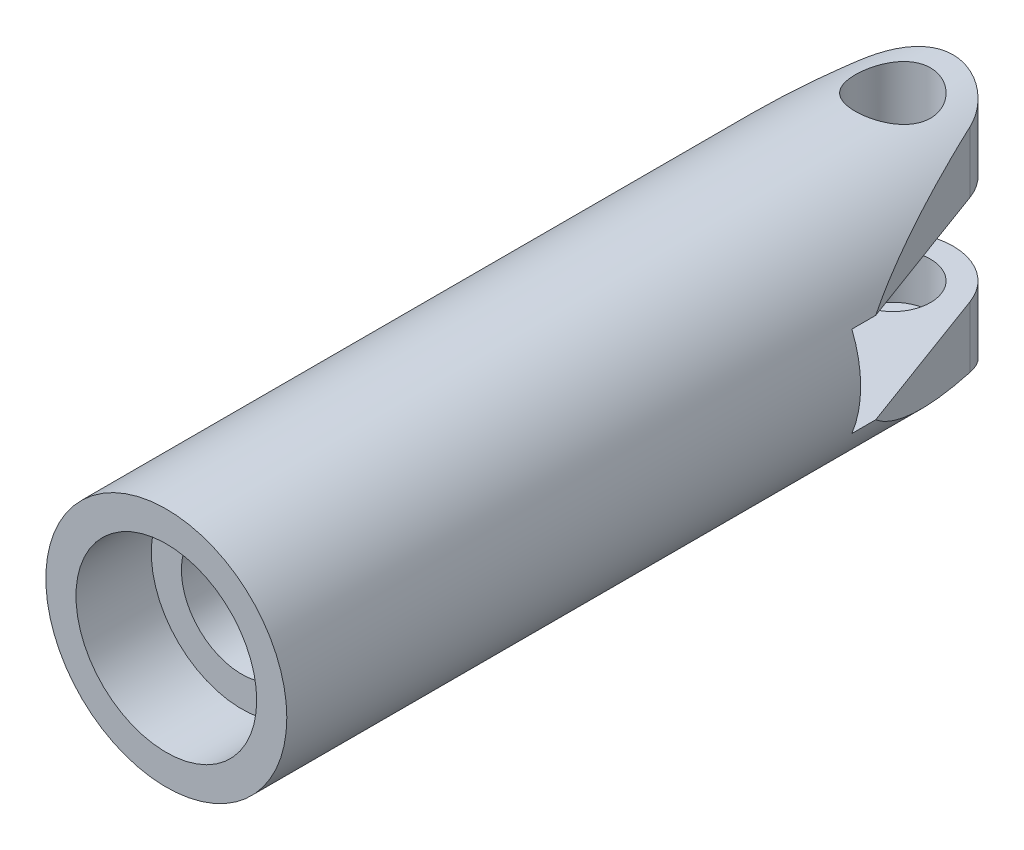
ISO-10303-21;
HEADER;
FILE_DESCRIPTION(('STEP AP214'),'2;1');
FILE_NAME('part.step','',(''),(''),'','','');
FILE_SCHEMA(('AUTOMOTIVE_DESIGN { 1 0 10303 214 1 1 1 1 }'));
ENDSEC;
DATA;
#1=APPLICATION_CONTEXT('core data for automotive mechanical design processes');
#2=APPLICATION_PROTOCOL_DEFINITION('international standard','automotive_design',2000,#1);
#3=PRODUCT_CONTEXT('',#1,'mechanical');
#4=PRODUCT('Part','Part','',(#3));
#5=PRODUCT_RELATED_PRODUCT_CATEGORY('part','',(#4));
#6=PRODUCT_DEFINITION_FORMATION('','',#4);
#7=PRODUCT_DEFINITION_CONTEXT('part definition',#1,'design');
#8=PRODUCT_DEFINITION('design','',#6,#7);
#9=PRODUCT_DEFINITION_SHAPE('','',#8);
#10=(LENGTH_UNIT() NAMED_UNIT(*) SI_UNIT(.MILLI.,.METRE.));
#11=(NAMED_UNIT(*) PLANE_ANGLE_UNIT() SI_UNIT($,.RADIAN.));
#12=(NAMED_UNIT(*) SI_UNIT($,.STERADIAN.) SOLID_ANGLE_UNIT());
#13=UNCERTAINTY_MEASURE_WITH_UNIT(LENGTH_MEASURE(1.E-05),#10,'distance_accuracy_value','');
#14=(GEOMETRIC_REPRESENTATION_CONTEXT(3) GLOBAL_UNCERTAINTY_ASSIGNED_CONTEXT((#13)) GLOBAL_UNIT_ASSIGNED_CONTEXT((#10,
#11,#12)) REPRESENTATION_CONTEXT('',''));
#15=CARTESIAN_POINT('',(0.,0.,0.));
#16=DIRECTION('',(0.,0.,1.));
#17=DIRECTION('',(1.,0.,0.));
#18=AXIS2_PLACEMENT_3D('',#15,#16,#17);
#19=CARTESIAN_POINT('',(0.,4.,0.));
#20=DIRECTION('',(0.,0.,-1.));
#21=DIRECTION('',(-1.,0.,0.));
#22=AXIS2_PLACEMENT_3D('',#19,#20,#21);
#23=PLANE('',#22);
#24=CARTESIAN_POINT('',(0.,0.,0.));
#25=DIRECTION('',(0.,0.,1.));
#26=DIRECTION('',(1.,0.,0.));
#27=AXIS2_PLACEMENT_3D('',#24,#25,#26);
#28=CIRCLE('',#27,4.);
#29=CARTESIAN_POINT('',(2.64575131106459,3.,0.));
#30=VERTEX_POINT('',#29);
#31=CARTESIAN_POINT('',(-2.64575131106459,3.,0.));
#32=VERTEX_POINT('',#31);
#33=EDGE_CURVE('E267',#30,#32,#28,.T.);
#34=ORIENTED_EDGE('',*,*,#33,.T.);
#35=DIRECTION('',(1.,0.,0.));
#36=VECTOR('',#35,1.);
#37=CARTESIAN_POINT('',(-8.,3.,0.));
#38=LINE('',#37,#36);
#39=EDGE_CURVE('E154',#32,#30,#38,.T.);
#40=ORIENTED_EDGE('',*,*,#39,.T.);
#41=EDGE_LOOP('',(#34,#40));
#42=FACE_BOUND('',#41,.T.);
#43=ADVANCED_FACE('F39',(#42),#23,.F.);
#44=CARTESIAN_POINT('',(0.,-8.,-10.1358699596964));
#45=DIRECTION('',(0.,1.,0.));
#46=DIRECTION('',(0.,0.,1.));
#47=AXIS2_PLACEMENT_3D('',#44,#45,#46);
#48=CYLINDRICAL_SURFACE('',#47,4.);
#49=CARTESIAN_POINT('',(0.,3.,-10.1358699596964));
#50=DIRECTION('',(0.,1.,0.));
#51=DIRECTION('',(0.,0.,1.));
#52=AXIS2_PLACEMENT_3D('',#49,#50,#51);
#53=CIRCLE('',#52,4.);
#54=CARTESIAN_POINT('',(-3.75306596581388,3.,-11.5195230434748));
#55=VERTEX_POINT('',#54);
#56=CARTESIAN_POINT('',(3.75306596581388,3.,-11.5195230434748));
#57=VERTEX_POINT('',#56);
#58=EDGE_CURVE('E146',#55,#57,#53,.F.);
#59=ORIENTED_EDGE('',*,*,#58,.F.);
#60=DIRECTION('',(0.,1.,0.));
#61=VECTOR('',#60,1.);
#62=CARTESIAN_POINT('',(-3.75306596581388,-8.,-11.5195230434748));
#63=LINE('',#62,#61);
#64=CARTESIAN_POINT('',(-3.75306596581388,7.06501916885223,-11.5195230434748));
#65=VERTEX_POINT('',#64);
#66=EDGE_CURVE('E272',#55,#65,#63,.T.);
#67=ORIENTED_EDGE('',*,*,#66,.T.);
#68=CARTESIAN_POINT('',(-3.75306596581388,7.06501916885223,-11.5195230434748));
#69=CARTESIAN_POINT('',(-3.67321717342783,7.10741203170038,-11.7361585646745));
#70=CARTESIAN_POINT('',(-3.57526881472254,7.15775965369322,-11.9440396558015));
#71=CARTESIAN_POINT('',(-3.34682107513861,7.26738060831154,-12.33827026615));
#72=CARTESIAN_POINT('',(-3.21635304038792,7.32664532395912,-12.5246402685367));
#73=CARTESIAN_POINT('',(-2.9265878785767,7.44712457160427,-12.8719681102532));
#74=CARTESIAN_POINT('',(-2.7673389811262,7.50833570258459,-13.0329676319043));
#75=CARTESIAN_POINT('',(-2.42282818554495,7.62646408823224,-13.3266425807865));
#76=CARTESIAN_POINT('',(-2.23755793784998,7.68337995561565,-13.4593088820589));
#77=CARTESIAN_POINT('',(-1.94142361987171,7.76154950669471,-13.6350774361294));
#78=CARTESIAN_POINT('',(-1.83854050766283,7.78662030413946,-13.6902292660873));
#79=CARTESIAN_POINT('',(-1.62773508045759,7.8333967756536,-13.7915684593621));
#80=CARTESIAN_POINT('',(-1.51981511980381,7.85510400183882,-13.8377599599056));
#81=CARTESIAN_POINT('',(-1.29974131714923,7.89450239122218,-13.9206415321349));
#82=CARTESIAN_POINT('',(-1.18758962055311,7.91219555839026,-13.9573363462191));
#83=CARTESIAN_POINT('',(-0.959898137743009,7.94303374711078,-14.0207838083736));
#84=CARTESIAN_POINT('',(-0.844358745038953,7.95617929465564,-14.0475376062808));
#85=CARTESIAN_POINT('',(-0.621638432735177,7.97652188694362,-14.0887410992411));
#86=CARTESIAN_POINT('',(-0.514663672093364,7.98415416541228,-14.1040947286663));
#87=CARTESIAN_POINT('',(-0.299562151959895,7.9951147886636,-14.1261020956364));
#88=CARTESIAN_POINT('',(-0.191435020529066,7.99844169864889,-14.1327529329166));
#89=CARTESIAN_POINT('',(0.0249739770571556,8.00069236310485,-14.1372549693558));
#90=CARTESIAN_POINT('',(0.133255688076692,7.9996191089914,-14.1351121468121));
#91=CARTESIAN_POINT('',(0.349197015514124,7.9931054678633,-14.1220669834781));
#92=CARTESIAN_POINT('',(0.45685638958584,7.98766348165953,-14.111161435061));
#93=CARTESIAN_POINT('',(0.663493843348697,7.9730654192747,-14.0817442958082));
#94=CARTESIAN_POINT('',(0.762570945219638,7.96418210596579,-14.0637902235977));
#95=CARTESIAN_POINT('',(0.958751404768767,7.94295620933996,-14.0205708550239));
#96=CARTESIAN_POINT('',(1.05585407634882,7.9306124448558,-13.9953030621484));
#97=CARTESIAN_POINT('',(1.3431932390107,7.8887994635617,-13.9088990127639));
#98=CARTESIAN_POINT('',(1.52965678724927,7.85453392031714,-13.8371336980294));
#99=CARTESIAN_POINT('',(1.89559084579659,7.77453342407915,-13.6642503729245));
#100=CARTESIAN_POINT('',(2.07443946921702,7.7283774819255,-13.5620269079434));
#101=CARTESIAN_POINT('',(2.41330571960495,7.62936138764791,-13.3324120952776));
#102=CARTESIAN_POINT('',(2.57330451391722,7.57649463853392,-13.2049959124765));
#103=CARTESIAN_POINT('',(2.88672323724158,7.46306499314165,-12.9138394763338));
#104=CARTESIAN_POINT('',(3.03785901487783,7.40226312825961,-12.7477336733152));
#105=CARTESIAN_POINT('',(3.31061405790125,7.28435968541975,-12.3919514089634));
#106=CARTESIAN_POINT('',(3.43228532672024,7.2272517204608,-12.2023173820821));
#107=CARTESIAN_POINT('',(3.57858545767086,7.15512603484303,-11.9251381101581));
#108=CARTESIAN_POINT('',(3.61714063715322,7.13568081606946,-11.8458706426427));
#109=CARTESIAN_POINT('',(3.68903884278695,7.09877531842026,-11.6846637530895));
#110=CARTESIAN_POINT('',(3.7223872449098,7.08131299736317,-11.6027271939804));
#111=CARTESIAN_POINT('',(3.75306596581388,7.06501916885223,-11.5195230434748));
#112=B_SPLINE_CURVE_WITH_KNOTS('',3,(#68,#69,#70,#71,#72,#73,#74,#75,#76,#77,#78,#79,#80,#81,
#82,#83,#84,#85,#86,#87,#88,#89,#90,#91,#92,#93,#94,#95,#96,#97,#98,#99,#100,#101,#102,#103,
#104,#105,#106,#107,#108,#109,#110,#111),.UNSPECIFIED.,.F.,.F.,(4,2,2,2,2,2,2,2,2,2,2,2,2,2,2,2,
2,2,2,2,2,4),(0.,0.702589029157703,1.40450342525563,2.10525231245786,2.80622656736534,
3.16400754545898,3.52162293111451,3.87905938684683,4.23645448648675,4.56104659447965,
4.88574684747181,5.21022639224705,5.53482476804449,5.83771233200689,6.14070340772577,
6.74609716690687,7.37689762073541,8.00832304965702,8.70331989362461,9.39708101267039,
9.66770628637359,9.93805026623482),.UNSPECIFIED.);
#113=CARTESIAN_POINT('',(3.75306596581388,7.06501916885223,-11.5195230434748));
#114=VERTEX_POINT('',#113);
#115=EDGE_CURVE('E214',#65,#114,#112,.T.);
#116=ORIENTED_EDGE('',*,*,#115,.T.);
#117=DIRECTION('',(0.,1.,0.));
#118=VECTOR('',#117,1.);
#119=CARTESIAN_POINT('',(3.75306596581388,-8.,-11.5195230434748));
#120=LINE('',#119,#118);
#121=EDGE_CURVE('E273',#57,#114,#120,.T.);
#122=ORIENTED_EDGE('',*,*,#121,.F.);
#123=EDGE_LOOP('',(#59,#67,#116,#122));
#124=FACE_BOUND('',#123,.T.);
#125=ADVANCED_FACE('F210',(#124),#48,.T.);
#126=CARTESIAN_POINT('',(-7.04275207187523,-8.,-2.59647064861111));
#127=DIRECTION('',(-0.93826649145347,0.,-0.345913270944605));
#128=DIRECTION('',(-0.345913270944605,0.,0.93826649145347));
#129=AXIS2_PLACEMENT_3D('',#126,#127,#128);
#130=PLANE('',#129);
#131=DIRECTION('',(0.345913270944605,0.,-0.93826649145347));
#132=VECTOR('',#131,1.);
#133=CARTESIAN_POINT('',(-7.04275207187523,3.,-2.59647064861111));
#134=LINE('',#133,#132);
#135=CARTESIAN_POINT('',(-7.41619848709566,3.,-1.58352235438142));
#136=VERTEX_POINT('',#135);
#137=EDGE_CURVE('E282',#136,#55,#134,.T.);
#138=ORIENTED_EDGE('',*,*,#137,.F.);
#139=CARTESIAN_POINT('',(0.,0.,-21.6994621545751));
#140=DIRECTION('',(-0.93826649145347,0.,-0.345913270944605));
#141=DIRECTION('',(-0.345913270944605,0.,0.93826649145347));
#142=AXIS2_PLACEMENT_3D('',#139,#140,#141);
#143=ELLIPSE('',#142,23.1271843897574,8.);
#144=EDGE_CURVE('E227',#136,#65,#143,.T.);
#145=ORIENTED_EDGE('',*,*,#144,.T.);
#146=ORIENTED_EDGE('',*,*,#66,.F.);
#147=EDGE_LOOP('',(#138,#145,#146));
#148=FACE_BOUND('',#147,.T.);
#149=ADVANCED_FACE('F200',(#148),#130,.T.);
#150=CARTESIAN_POINT('',(7.04275207187523,-8.,-2.59647064861111));
#151=DIRECTION('',(-0.93826649145347,0.,0.345913270944606));
#152=DIRECTION('',(0.345913270944606,0.,0.93826649145347));
#153=AXIS2_PLACEMENT_3D('',#150,#151,#152);
#154=PLANE('',#153);
#155=CARTESIAN_POINT('',(0.,0.,-21.6994621545751));
#156=DIRECTION('',(-0.93826649145347,0.,0.345913270944606));
#157=DIRECTION('',(0.345913270944606,0.,0.93826649145347));
#158=AXIS2_PLACEMENT_3D('',#155,#156,#157);
#159=ELLIPSE('',#158,23.1271843897574,8.);
#160=CARTESIAN_POINT('',(7.41619848709566,3.,-1.58352235438142));
#161=VERTEX_POINT('',#160);
#162=EDGE_CURVE('E242',#161,#114,#159,.T.);
#163=ORIENTED_EDGE('',*,*,#162,.F.);
#164=DIRECTION('',(-0.345913270944606,0.,-0.93826649145347));
#165=VECTOR('',#164,1.);
#166=CARTESIAN_POINT('',(7.04275207187523,3.,-2.59647064861111));
#167=LINE('',#166,#165);
#168=EDGE_CURVE('E11',#161,#57,#167,.T.);
#169=ORIENTED_EDGE('',*,*,#168,.T.);
#170=ORIENTED_EDGE('',*,*,#121,.T.);
#171=EDGE_LOOP('',(#163,#169,#170));
#172=FACE_BOUND('',#171,.T.);
#173=ADVANCED_FACE('F204',(#172),#154,.F.);
#174=CARTESIAN_POINT('',(0.,0.,12.9751699335868));
#175=DIRECTION('',(0.,0.,1.));
#176=DIRECTION('',(1.,0.,0.));
#177=AXIS2_PLACEMENT_3D('',#174,#175,#176);
#178=CYLINDRICAL_SURFACE('',#177,8.);
#179=CARTESIAN_POINT('',(0.,8.,-7.63586995969642));
#180=CARTESIAN_POINT('',(-0.136878370349093,7.99999931755979,-7.63587085287157));
#181=CARTESIAN_POINT('',(-0.273766105005718,7.99645389969682,-7.64714841358532));
#182=CARTESIAN_POINT('',(-0.543538419176897,7.98265788177613,-7.69184244277489));
#183=CARTESIAN_POINT('',(-0.676422085451815,7.97240576399719,-7.72526392242513));
#184=CARTESIAN_POINT('',(-0.934257087301613,7.94631631395819,-7.81300870208789));
#185=CARTESIAN_POINT('',(-1.05922035397161,7.93048762998049,-7.86729964900235));
#186=CARTESIAN_POINT('',(-1.29826960469292,7.89487938322185,-7.99510459505307));
#187=CARTESIAN_POINT('',(-1.41235387088977,7.8750991979981,-8.06862162325759));
#188=CARTESIAN_POINT('',(-1.62993066990456,7.83300427480564,-8.23518194373113));
#189=CARTESIAN_POINT('',(-1.73304005631332,7.81063431853977,-8.32871172981856));
#190=CARTESIAN_POINT('',(-1.92239476407399,7.76620092748417,-8.53160674452351));
#191=CARTESIAN_POINT('',(-2.00863694579739,7.74413755046914,-8.64097491468551));
#192=CARTESIAN_POINT('',(-2.16388672966227,7.70222289396344,-8.87575908731258));
#193=CARTESIAN_POINT('',(-2.23241568300258,7.68243976603591,-9.00150491475086));
#194=CARTESIAN_POINT('',(-2.34719482153343,7.64815603598468,-9.26345458966016));
#195=CARTESIAN_POINT('',(-2.39345087543889,7.63365404257377,-9.39965567128428));
#196=CARTESIAN_POINT('',(-2.46096919860067,7.61215213969001,-9.67432611460054));
#197=CARTESIAN_POINT('',(-2.48294220015729,7.60493945859016,-9.81260364697412));
#198=CARTESIAN_POINT('',(-2.50349110073976,7.598201102819,-10.0910561975202));
#199=CARTESIAN_POINT('',(-2.50207321991544,7.59867338454668,-10.2312307013397));
#200=CARTESIAN_POINT('',(-2.47643649465479,7.60706378150876,-10.5036188802344));
#201=CARTESIAN_POINT('',(-2.45312115738766,7.61468683491897,-10.6359282114195));
#202=CARTESIAN_POINT('',(-2.38581626711252,7.63604051304977,-10.8946542727711));
#203=CARTESIAN_POINT('',(-2.34182451689101,7.64977178686229,-11.021070375114));
#204=CARTESIAN_POINT('',(-2.23377749362555,7.68202088028593,-11.2665738485617));
#205=CARTESIAN_POINT('',(-2.16943851324164,7.70060569321648,-11.3855271810804));
#206=CARTESIAN_POINT('',(-2.02272041475696,7.74043713160139,-11.6112454954547));
#207=CARTESIAN_POINT('',(-1.94033661043155,7.76168444789102,-11.7180073002038));
#208=CARTESIAN_POINT('',(-1.75543390836425,7.80563055600986,-11.9214198465304));
#209=CARTESIAN_POINT('',(-1.65216914118564,7.82835139211391,-12.0173890752558));
#210=CARTESIAN_POINT('',(-1.43072881619106,7.8718314151916,-12.1908137468558));
#211=CARTESIAN_POINT('',(-1.31255215469804,7.89259045676744,-12.2682678181348));
#212=CARTESIAN_POINT('',(-1.06332922093091,7.93002589780382,-12.402925336899));
#213=CARTESIAN_POINT('',(-0.93218981383856,7.94666921296415,-12.4599662306244));
#214=CARTESIAN_POINT('',(-0.66153595556529,7.97375911657108,-12.5509759613995));
#215=CARTESIAN_POINT('',(-0.522024061449217,7.98420758650304,-12.5849518041732));
#216=CARTESIAN_POINT('',(-0.24437031458069,7.99742778790026,-12.6277060448544));
#217=CARTESIAN_POINT('',(-0.106383697577686,8.00048045790873,-12.6374070468835));
#218=CARTESIAN_POINT('',(0.169260611465171,7.99939599461967,-12.6339375064218));
#219=CARTESIAN_POINT('',(0.306918348613017,7.9952599116227,-12.6207703050512));
#220=CARTESIAN_POINT('',(0.574438665951697,7.98044727539523,-12.5726787744836));
#221=CARTESIAN_POINT('',(0.704409956841872,7.96993586221374,-12.5383034244714));
#222=CARTESIAN_POINT('',(0.956703857722752,7.94360242758579,-12.449441254963));
#223=CARTESIAN_POINT('',(1.07902552089812,7.92777975028687,-12.3949519516464));
#224=CARTESIAN_POINT('',(1.31586481334438,7.89197085518848,-12.265923526599));
#225=CARTESIAN_POINT('',(1.43011947957558,7.87189253635335,-12.1909279847028));
#226=CARTESIAN_POINT('',(1.64473170192052,7.82986820006859,-12.0235635394616));
#227=CARTESIAN_POINT('',(1.7450854760879,7.80792167695774,-11.9311899242071));
#228=CARTESIAN_POINT('',(1.93317492583804,7.76353989766282,-11.7273521795922));
#229=CARTESIAN_POINT('',(2.02025304679062,7.74111973412882,-11.615276632218));
#230=CARTESIAN_POINT('',(2.17442500490303,7.69923894191211,-11.3776167269429));
#231=CARTESIAN_POINT('',(2.24151915946859,7.6797782662262,-11.2520325836425));
#232=CARTESIAN_POINT('',(2.35340166961085,7.64623564661738,-10.9911796139555));
#233=CARTESIAN_POINT('',(2.39827639112025,7.63213292713748,-10.855950660825));
#234=CARTESIAN_POINT('',(2.4644578863618,7.6110234168862,-10.5793249731992));
#235=CARTESIAN_POINT('',(2.48577362827989,7.60401392602455,-10.4379306070094));
#236=CARTESIAN_POINT('',(2.50358812316251,7.59816585427753,-10.1598617845356));
#237=CARTESIAN_POINT('',(2.50116559243271,7.59897209200283,-10.0232630520016));
#238=CARTESIAN_POINT('',(2.47417636257668,7.60780180751807,-9.75252078981254));
#239=CARTESIAN_POINT('',(2.44961069645024,7.61582494863207,-9.61837714592295));
#240=CARTESIAN_POINT('',(2.37975459827235,7.63793628366779,-9.35828188051263));
#241=CARTESIAN_POINT('',(2.33477284812017,7.65193396380513,-9.23223907750969));
#242=CARTESIAN_POINT('',(2.22560454669999,7.68439408509127,-8.98938913262841));
#243=CARTESIAN_POINT('',(2.16141408888474,7.70285743429343,-8.87258387553961));
#244=CARTESIAN_POINT('',(2.01271350026987,7.74306974067005,-8.64657801881679));
#245=CARTESIAN_POINT('',(1.92750667048265,7.76491897845913,-8.53785370069594));
#246=CARTESIAN_POINT('',(1.7404179928096,7.80897997642419,-8.33589730347242));
#247=CARTESIAN_POINT('',(1.63853168468878,7.83119183213308,-8.2426693817143));
#248=CARTESIAN_POINT('',(1.41697332564669,7.87434543904947,-8.07130488297055));
#249=CARTESIAN_POINT('',(1.29682914897477,7.89522203461345,-7.99376048679652));
#250=CARTESIAN_POINT('',(1.0445582760273,7.93253538593755,-7.86007212941751));
#251=CARTESIAN_POINT('',(0.912436315590898,7.94897388631644,-7.80391975541274));
#252=CARTESIAN_POINT('',(0.651495270747958,7.9744130146694,-7.71868722447949));
#253=CARTESIAN_POINT('',(0.523340674225093,7.98392481612283,-7.68772022508574));
#254=CARTESIAN_POINT('',(0.263459790880495,7.99671800680967,-7.64631323976099));
#255=CARTESIAN_POINT('',(0.13173423227935,8.00000065679286,-7.63586910008841));
#256=CARTESIAN_POINT('',(0.,8.,-7.63586995969642));
#257=B_SPLINE_CURVE_WITH_KNOTS('',3,(#179,#180,#181,#182,#183,#184,#185,#186,#187,#188,#189,
#190,#191,#192,#193,#194,#195,#196,#197,#198,#199,#200,#201,#202,#203,#204,#205,#206,#207,#208,
#209,#210,#211,#212,#213,#214,#215,#216,#217,#218,#219,#220,#221,#222,#223,#224,#225,#226,#227,
#228,#229,#230,#231,#232,#233,#234,#235,#236,#237,#238,#239,#240,#241,#242,#243,#244,#245,#246,
#247,#248,#249,#250,#251,#252,#253,#254,#255,#256),.UNSPECIFIED.,.T.,.F.,(4,2,2,2,2,2,2,2,2,2,2,
2,2,2,2,2,2,2,2,2,2,2,2,2,2,2,2,2,2,2,2,2,2,2,2,2,2,2,4),(0.,0.41015089886502,0.820394646698133,
1.23000495840487,1.63967984311678,2.06075644390317,2.48191134862552,2.91347542494988,
3.34492572559054,3.7633830033442,4.18172900590277,4.58353834844338,4.98539039958126,
5.3931128544109,5.80094132020717,6.227334945592,6.65376014826606,7.0835092137954,
7.51312768989108,7.92615137096475,8.33911471298725,8.74181253445744,9.14456010068999,
9.55712649476686,9.96980491418519,10.3988355742628,10.8278594196742,11.2552023150671,
11.6823824779468,12.0902440696666,12.4980866352126,12.8999582681244,13.3019116867944,
13.7195902803182,14.1373807476578,14.5688133627192,15.0000761335177,15.3948927332218,
15.7896294154519),.UNSPECIFIED.);
#258=CARTESIAN_POINT('',(0.,8.,-7.63586995969642));
#259=VERTEX_POINT('',#258);
#260=EDGE_CURVE('E158',#259,#259,#257,.T.);
#261=ORIENTED_EDGE('',*,*,#260,.T.);
#262=EDGE_LOOP('',(#261));
#263=FACE_BOUND('',#262,.T.);
#264=CARTESIAN_POINT('',(0.,0.,38.1));
#265=DIRECTION('',(0.,0.,1.));
#266=DIRECTION('',(1.,0.,0.));
#267=AXIS2_PLACEMENT_3D('',#264,#265,#266);
#268=CIRCLE('',#267,7.99999999999999);
#269=CARTESIAN_POINT('',(7.99999999999999,0.,38.1));
#270=VERTEX_POINT('',#269);
#271=EDGE_CURVE('E251',#270,#270,#268,.T.);
#272=ORIENTED_EDGE('',*,*,#271,.F.);
#273=EDGE_LOOP('',(#272));
#274=FACE_BOUND('',#273,.T.);
#275=CARTESIAN_POINT('',(0.,0.,0.));
#276=DIRECTION('',(0.,0.,1.));
#277=DIRECTION('',(0.,-1.,0.));
#278=AXIS2_PLACEMENT_3D('',#275,#276,#277);
#279=CIRCLE('',#278,8.);
#280=CARTESIAN_POINT('',(7.41619848709566,-3.,0.));
#281=VERTEX_POINT('',#280);
#282=CARTESIAN_POINT('',(7.41619848709566,3.,0.));
#283=VERTEX_POINT('',#282);
#284=EDGE_CURVE('E139',#281,#283,#279,.T.);
#285=ORIENTED_EDGE('',*,*,#284,.T.);
#286=DIRECTION('',(0.,0.,1.));
#287=VECTOR('',#286,1.);
#288=CARTESIAN_POINT('',(7.41619848709566,3.,12.9751699335868));
#289=LINE('',#288,#287);
#290=EDGE_CURVE('E285',#283,#161,#289,.F.);
#291=ORIENTED_EDGE('',*,*,#290,.T.);
#292=ORIENTED_EDGE('',*,*,#162,.T.);
#293=ORIENTED_EDGE('',*,*,#115,.F.);
#294=ORIENTED_EDGE('',*,*,#144,.F.);
#295=DIRECTION('',(0.,0.,1.));
#296=VECTOR('',#295,1.);
#297=CARTESIAN_POINT('',(-7.41619848709566,3.,12.9751699335868));
#298=LINE('',#297,#296);
#299=CARTESIAN_POINT('',(-7.41619848709566,3.,0.));
#300=VERTEX_POINT('',#299);
#301=EDGE_CURVE('E134',#136,#300,#298,.T.);
#302=ORIENTED_EDGE('',*,*,#301,.T.);
#303=CARTESIAN_POINT('',(-7.41619848709566,-3.,0.));
#304=VERTEX_POINT('',#303);
#305=EDGE_CURVE('E127',#300,#304,#279,.T.);
#306=ORIENTED_EDGE('',*,*,#305,.T.);
#307=DIRECTION('',(0.,0.,1.));
#308=VECTOR('',#307,1.);
#309=CARTESIAN_POINT('',(-7.41619848709566,-3.,12.9751699335868));
#310=LINE('',#309,#308);
#311=CARTESIAN_POINT('',(-7.41619848709566,-3.,-1.58352235438143));
#312=VERTEX_POINT('',#311);
#313=EDGE_CURVE('E131',#304,#312,#310,.F.);
#314=ORIENTED_EDGE('',*,*,#313,.T.);
#315=CARTESIAN_POINT('',(-3.75306596581388,-7.06501916885223,-11.5195230434748));
#316=VERTEX_POINT('',#315);
#317=EDGE_CURVE('E229',#316,#312,#143,.T.);
#318=ORIENTED_EDGE('',*,*,#317,.F.);
#319=CARTESIAN_POINT('',(3.75306596581388,-7.06501916885223,-11.5195230434748));
#320=CARTESIAN_POINT('',(3.67321717342783,-7.10741203170038,-11.7361585646745));
#321=CARTESIAN_POINT('',(3.57526881472254,-7.15775965369322,-11.9440396558015));
#322=CARTESIAN_POINT('',(3.34682107513861,-7.26738060831154,-12.33827026615));
#323=CARTESIAN_POINT('',(3.21635304038792,-7.32664532395912,-12.5246402685367));
#324=CARTESIAN_POINT('',(2.9265878785767,-7.44712457160427,-12.8719681102532));
#325=CARTESIAN_POINT('',(2.7673389811262,-7.50833570258459,-13.0329676319043));
#326=CARTESIAN_POINT('',(2.42282818554495,-7.62646408823224,-13.3266425807865));
#327=CARTESIAN_POINT('',(2.23755793784998,-7.68337995561565,-13.4593088820589));
#328=CARTESIAN_POINT('',(1.94142361987171,-7.76154950669471,-13.6350774361294));
#329=CARTESIAN_POINT('',(1.83854050766283,-7.78662030413946,-13.6902292660873));
#330=CARTESIAN_POINT('',(1.62773508045759,-7.8333967756536,-13.7915684593621));
#331=CARTESIAN_POINT('',(1.51981511980381,-7.85510400183882,-13.8377599599056));
#332=CARTESIAN_POINT('',(1.29974131714923,-7.89450239122218,-13.9206415321349));
#333=CARTESIAN_POINT('',(1.18758962055311,-7.91219555839026,-13.9573363462191));
#334=CARTESIAN_POINT('',(0.959898137743009,-7.94303374711078,-14.0207838083736));
#335=CARTESIAN_POINT('',(0.844358745038953,-7.95617929465564,-14.0475376062808));
#336=CARTESIAN_POINT('',(0.621638432735177,-7.97652188694362,-14.0887410992411));
#337=CARTESIAN_POINT('',(0.514663672093364,-7.98415416541228,-14.1040947286663));
#338=CARTESIAN_POINT('',(0.299562151959895,-7.9951147886636,-14.1261020956364));
#339=CARTESIAN_POINT('',(0.191435020529066,-7.99844169864889,-14.1327529329166));
#340=CARTESIAN_POINT('',(-0.0249739770571556,-8.00069236310485,-14.1372549693558));
#341=CARTESIAN_POINT('',(-0.133255688076692,-7.9996191089914,-14.1351121468121));
#342=CARTESIAN_POINT('',(-0.349197015514124,-7.9931054678633,-14.1220669834781));
#343=CARTESIAN_POINT('',(-0.45685638958584,-7.98766348165953,-14.111161435061));
#344=CARTESIAN_POINT('',(-0.663493843348697,-7.9730654192747,-14.0817442958082));
#345=CARTESIAN_POINT('',(-0.762570945219638,-7.96418210596579,-14.0637902235977));
#346=CARTESIAN_POINT('',(-0.958751404768767,-7.94295620933996,-14.0205708550239));
#347=CARTESIAN_POINT('',(-1.05585407634882,-7.9306124448558,-13.9953030621484));
#348=CARTESIAN_POINT('',(-1.3431932390107,-7.8887994635617,-13.9088990127639));
#349=CARTESIAN_POINT('',(-1.52965678724927,-7.85453392031714,-13.8371336980294));
#350=CARTESIAN_POINT('',(-1.89559084579659,-7.77453342407915,-13.6642503729245));
#351=CARTESIAN_POINT('',(-2.07443946921702,-7.7283774819255,-13.5620269079434));
#352=CARTESIAN_POINT('',(-2.41330571960495,-7.62936138764791,-13.3324120952776));
#353=CARTESIAN_POINT('',(-2.57330451391722,-7.57649463853392,-13.2049959124765));
#354=CARTESIAN_POINT('',(-2.88672323724158,-7.46306499314165,-12.9138394763338));
#355=CARTESIAN_POINT('',(-3.03785901487783,-7.40226312825961,-12.7477336733152));
#356=CARTESIAN_POINT('',(-3.31061405790125,-7.28435968541975,-12.3919514089634));
#357=CARTESIAN_POINT('',(-3.43228532672024,-7.2272517204608,-12.2023173820821));
#358=CARTESIAN_POINT('',(-3.57858545767086,-7.15512603484303,-11.9251381101581));
#359=CARTESIAN_POINT('',(-3.61714063715322,-7.13568081606946,-11.8458706426427));
#360=CARTESIAN_POINT('',(-3.68903884278695,-7.09877531842026,-11.6846637530895));
#361=CARTESIAN_POINT('',(-3.7223872449098,-7.08131299736317,-11.6027271939804));
#362=CARTESIAN_POINT('',(-3.75306596581388,-7.06501916885223,-11.5195230434748));
#363=B_SPLINE_CURVE_WITH_KNOTS('',3,(#319,#320,#321,#322,#323,#324,#325,#326,#327,#328,#329,
#330,#331,#332,#333,#334,#335,#336,#337,#338,#339,#340,#341,#342,#343,#344,#345,#346,#347,#348,
#349,#350,#351,#352,#353,#354,#355,#356,#357,#358,#359,#360,#361,#362),.UNSPECIFIED.,.F.,.F.,(4,
2,2,2,2,2,2,2,2,2,2,2,2,2,2,2,2,2,2,2,2,4),(0.,0.702589029157703,1.40450342525563,
2.10525231245786,2.80622656736534,3.16400754545898,3.52162293111451,3.87905938684683,
4.23645448648675,4.56104659447965,4.88574684747181,5.21022639224705,5.53482476804449,
5.83771233200689,6.14070340772577,6.74609716690687,7.37689762073541,8.00832304965702,
8.70331989362461,9.39708101267039,9.66770628637359,9.93805026623482),.UNSPECIFIED.);
#364=CARTESIAN_POINT('',(3.75306596581388,-7.06501916885223,-11.5195230434748));
#365=VERTEX_POINT('',#364);
#366=EDGE_CURVE('E221',#365,#316,#363,.T.);
#367=ORIENTED_EDGE('',*,*,#366,.F.);
#368=CARTESIAN_POINT('',(7.41619848709566,-3.,-1.58352235438142));
#369=VERTEX_POINT('',#368);
#370=EDGE_CURVE('E228',#365,#369,#159,.T.);
#371=ORIENTED_EDGE('',*,*,#370,.T.);
#372=DIRECTION('',(0.,0.,1.));
#373=VECTOR('',#372,1.);
#374=CARTESIAN_POINT('',(7.41619848709566,-3.,12.9751699335868));
#375=LINE('',#374,#373);
#376=EDGE_CURVE('E62',#369,#281,#375,.T.);
#377=ORIENTED_EDGE('',*,*,#376,.T.);
#378=EDGE_LOOP('',(#285,#291,#292,#293,#294,#302,#306,#314,#318,#367,#371,#377));
#379=FACE_BOUND('',#378,.T.);
#380=ADVANCED_FACE('F129',(#263,#274,#379),#178,.T.);
#381=CARTESIAN_POINT('',(-2.64575131106459,-3.,0.));
#382=VERTEX_POINT('',#381);
#383=CARTESIAN_POINT('',(2.64575131106459,-3.,0.));
#384=VERTEX_POINT('',#383);
#385=EDGE_CURVE('E270',#382,#384,#28,.T.);
#386=ORIENTED_EDGE('',*,*,#385,.T.);
#387=DIRECTION('',(1.,0.,0.));
#388=VECTOR('',#387,1.);
#389=CARTESIAN_POINT('',(-8.,-3.,0.));
#390=LINE('',#389,#388);
#391=EDGE_CURVE('E56',#382,#384,#390,.T.);
#392=ORIENTED_EDGE('',*,*,#391,.F.);
#393=EDGE_LOOP('',(#386,#392));
#394=FACE_BOUND('',#393,.T.);
#395=ADVANCED_FACE('F41',(#394),#23,.F.);
#396=CARTESIAN_POINT('',(0.,7.99999999999999,38.1));
#397=DIRECTION('',(0.,0.,-1.));
#398=DIRECTION('',(-1.,0.,0.));
#399=AXIS2_PLACEMENT_3D('',#396,#397,#398);
#400=PLANE('',#399);
#401=CARTESIAN_POINT('',(0.,0.,38.1));
#402=DIRECTION('',(0.,0.,1.));
#403=DIRECTION('',(1.,0.,0.));
#404=AXIS2_PLACEMENT_3D('',#401,#402,#403);
#405=CIRCLE('',#404,6.);
#406=CARTESIAN_POINT('',(6.,0.,38.1));
#407=VERTEX_POINT('',#406);
#408=EDGE_CURVE('E255',#407,#407,#405,.T.);
#409=ORIENTED_EDGE('',*,*,#408,.F.);
#410=EDGE_LOOP('',(#409));
#411=FACE_BOUND('',#410,.T.);
#412=ORIENTED_EDGE('',*,*,#271,.T.);
#413=EDGE_LOOP('',(#412));
#414=FACE_BOUND('',#413,.T.);
#415=ADVANCED_FACE('F304',(#411,#414),#400,.F.);
#416=CARTESIAN_POINT('',(0.,0.,12.9751699335868));
#417=DIRECTION('',(0.,0.,1.));
#418=DIRECTION('',(1.,0.,0.));
#419=AXIS2_PLACEMENT_3D('',#416,#417,#418);
#420=CYLINDRICAL_SURFACE('',#419,6.);
#421=CARTESIAN_POINT('',(0.,0.,33.1));
#422=DIRECTION('',(0.,0.,1.));
#423=DIRECTION('',(1.,0.,0.));
#424=AXIS2_PLACEMENT_3D('',#421,#422,#423);
#425=CIRCLE('',#424,6.);
#426=CARTESIAN_POINT('',(6.,0.,33.1));
#427=VERTEX_POINT('',#426);
#428=EDGE_CURVE('E259',#427,#427,#425,.T.);
#429=ORIENTED_EDGE('',*,*,#428,.F.);
#430=EDGE_LOOP('',(#429));
#431=FACE_BOUND('',#430,.T.);
#432=ORIENTED_EDGE('',*,*,#408,.T.);
#433=EDGE_LOOP('',(#432));
#434=FACE_BOUND('',#433,.T.);
#435=ADVANCED_FACE('F309',(#431,#434),#420,.F.);
#436=CARTESIAN_POINT('',(0.,6.,33.1));
#437=DIRECTION('',(0.,0.,-1.));
#438=DIRECTION('',(-1.,0.,0.));
#439=AXIS2_PLACEMENT_3D('',#436,#437,#438);
#440=PLANE('',#439);
#441=CARTESIAN_POINT('',(0.,0.,33.1));
#442=DIRECTION('',(0.,0.,1.));
#443=DIRECTION('',(1.,0.,0.));
#444=AXIS2_PLACEMENT_3D('',#441,#442,#443);
#445=CIRCLE('',#444,4.);
#446=CARTESIAN_POINT('',(4.,0.,33.1));
#447=VERTEX_POINT('',#446);
#448=EDGE_CURVE('E264',#447,#447,#445,.T.);
#449=ORIENTED_EDGE('',*,*,#448,.F.);
#450=EDGE_LOOP('',(#449));
#451=FACE_BOUND('',#450,.T.);
#452=ORIENTED_EDGE('',*,*,#428,.T.);
#453=EDGE_LOOP('',(#452));
#454=FACE_BOUND('',#453,.T.);
#455=ADVANCED_FACE('F375',(#451,#454),#440,.F.);
#456=CARTESIAN_POINT('',(0.,0.,12.9751699335868));
#457=DIRECTION('',(0.,0.,1.));
#458=DIRECTION('',(1.,0.,0.));
#459=AXIS2_PLACEMENT_3D('',#456,#457,#458);
#460=CYLINDRICAL_SURFACE('',#459,4.);
#461=ORIENTED_EDGE('',*,*,#33,.F.);
#462=CARTESIAN_POINT('',(0.,0.,0.));
#463=DIRECTION('',(0.,0.,1.));
#464=DIRECTION('',(0.,-1.,0.));
#465=AXIS2_PLACEMENT_3D('',#462,#463,#464);
#466=CIRCLE('',#465,4.);
#467=EDGE_CURVE('E278',#30,#384,#466,.F.);
#468=ORIENTED_EDGE('',*,*,#467,.T.);
#469=ORIENTED_EDGE('',*,*,#385,.F.);
#470=EDGE_CURVE('E140',#382,#32,#466,.F.);
#471=ORIENTED_EDGE('',*,*,#470,.T.);
#472=EDGE_LOOP('',(#461,#468,#469,#471));
#473=FACE_BOUND('',#472,.T.);
#474=ORIENTED_EDGE('',*,*,#448,.T.);
#475=EDGE_LOOP('',(#474));
#476=FACE_BOUND('',#475,.T.);
#477=ADVANCED_FACE('F208',(#473,#476),#460,.F.);
#478=CARTESIAN_POINT('',(-3.75306596581388,-3.,-11.5195230434748));
#479=VERTEX_POINT('',#478);
#480=EDGE_CURVE('E274',#316,#479,#63,.T.);
#481=ORIENTED_EDGE('',*,*,#480,.T.);
#482=CARTESIAN_POINT('',(0.,-3.,-10.1358699596964));
#483=DIRECTION('',(0.,-1.,0.));
#484=DIRECTION('',(0.,0.,-1.));
#485=AXIS2_PLACEMENT_3D('',#482,#483,#484);
#486=CIRCLE('',#485,4.);
#487=CARTESIAN_POINT('',(3.75306596581388,-3.,-11.5195230434748));
#488=VERTEX_POINT('',#487);
#489=EDGE_CURVE('E290',#488,#479,#486,.F.);
#490=ORIENTED_EDGE('',*,*,#489,.F.);
#491=EDGE_CURVE('E239',#365,#488,#120,.T.);
#492=ORIENTED_EDGE('',*,*,#491,.F.);
#493=ORIENTED_EDGE('',*,*,#366,.T.);
#494=EDGE_LOOP('',(#481,#490,#492,#493));
#495=FACE_BOUND('',#494,.T.);
#496=ADVANCED_FACE('F198',(#495),#48,.T.);
#497=DIRECTION('',(-0.345913270944605,0.,0.93826649145347));
#498=VECTOR('',#497,1.);
#499=CARTESIAN_POINT('',(-7.04275207187523,-3.,-2.59647064861111));
#500=LINE('',#499,#498);
#501=EDGE_CURVE('E145',#479,#312,#500,.T.);
#502=ORIENTED_EDGE('',*,*,#501,.F.);
#503=ORIENTED_EDGE('',*,*,#480,.F.);
#504=ORIENTED_EDGE('',*,*,#317,.T.);
#505=EDGE_LOOP('',(#502,#503,#504));
#506=FACE_BOUND('',#505,.T.);
#507=ADVANCED_FACE('F195',(#506),#130,.T.);
#508=ORIENTED_EDGE('',*,*,#491,.T.);
#509=DIRECTION('',(0.345913270944606,0.,0.93826649145347));
#510=VECTOR('',#509,1.);
#511=CARTESIAN_POINT('',(7.04275207187523,-3.,-2.59647064861111));
#512=LINE('',#511,#510);
#513=EDGE_CURVE('E49',#488,#369,#512,.T.);
#514=ORIENTED_EDGE('',*,*,#513,.T.);
#515=ORIENTED_EDGE('',*,*,#370,.F.);
#516=EDGE_LOOP('',(#508,#514,#515));
#517=FACE_BOUND('',#516,.T.);
#518=ADVANCED_FACE('F193',(#517),#154,.F.);
#519=CARTESIAN_POINT('',(-8.,-3.,0.));
#520=DIRECTION('',(0.,0.,1.));
#521=DIRECTION('',(0.,-1.,0.));
#522=AXIS2_PLACEMENT_3D('',#519,#520,#521);
#523=PLANE('',#522);
#524=ORIENTED_EDGE('',*,*,#284,.F.);
#525=EDGE_CURVE('E152',#384,#281,#390,.T.);
#526=ORIENTED_EDGE('',*,*,#525,.F.);
#527=ORIENTED_EDGE('',*,*,#467,.F.);
#528=EDGE_CURVE('E150',#30,#283,#38,.T.);
#529=ORIENTED_EDGE('',*,*,#528,.T.);
#530=EDGE_LOOP('',(#524,#526,#527,#529));
#531=FACE_BOUND('',#530,.T.);
#532=ADVANCED_FACE('F190',(#531),#523,.F.);
#533=EDGE_CURVE('E156',#300,#32,#38,.T.);
#534=ORIENTED_EDGE('',*,*,#533,.T.);
#535=ORIENTED_EDGE('',*,*,#470,.F.);
#536=EDGE_CURVE('E143',#304,#382,#390,.T.);
#537=ORIENTED_EDGE('',*,*,#536,.F.);
#538=ORIENTED_EDGE('',*,*,#305,.F.);
#539=EDGE_LOOP('',(#534,#535,#537,#538));
#540=FACE_BOUND('',#539,.T.);
#541=ADVANCED_FACE('F148',(#540),#523,.F.);
#542=CARTESIAN_POINT('',(-8.,3.,-25.0111276081953));
#543=DIRECTION('',(0.,1.,0.));
#544=DIRECTION('',(0.,0.,1.));
#545=AXIS2_PLACEMENT_3D('',#542,#543,#544);
#546=PLANE('',#545);
#547=CARTESIAN_POINT('',(0.,3.,-10.1358699596964));
#548=DIRECTION('',(0.,1.,0.));
#549=DIRECTION('',(0.,0.,1.));
#550=AXIS2_PLACEMENT_3D('',#547,#548,#549);
#551=CIRCLE('',#550,2.5);
#552=CARTESIAN_POINT('',(0.,3.,-7.63586995969642));
#553=VERTEX_POINT('',#552);
#554=EDGE_CURVE('E161',#553,#553,#551,.T.);
#555=ORIENTED_EDGE('',*,*,#554,.T.);
#556=EDGE_LOOP('',(#555));
#557=FACE_BOUND('',#556,.T.);
#558=ORIENTED_EDGE('',*,*,#39,.F.);
#559=ORIENTED_EDGE('',*,*,#533,.F.);
#560=ORIENTED_EDGE('',*,*,#301,.F.);
#561=ORIENTED_EDGE('',*,*,#137,.T.);
#562=ORIENTED_EDGE('',*,*,#58,.T.);
#563=ORIENTED_EDGE('',*,*,#168,.F.);
#564=ORIENTED_EDGE('',*,*,#290,.F.);
#565=ORIENTED_EDGE('',*,*,#528,.F.);
#566=EDGE_LOOP('',(#558,#559,#560,#561,#562,#563,#564,#565));
#567=FACE_BOUND('',#566,.T.);
#568=ADVANCED_FACE('F183',(#557,#567),#546,.F.);
#569=CARTESIAN_POINT('',(-8.,-3.,-25.0111276081953));
#570=DIRECTION('',(0.,-1.,0.));
#571=DIRECTION('',(0.,0.,-1.));
#572=AXIS2_PLACEMENT_3D('',#569,#570,#571);
#573=PLANE('',#572);
#574=CARTESIAN_POINT('',(0.,-3.,-10.1358699596964));
#575=DIRECTION('',(0.,-1.,0.));
#576=DIRECTION('',(0.,0.,-1.));
#577=AXIS2_PLACEMENT_3D('',#574,#575,#576);
#578=CIRCLE('',#577,2.5);
#579=CARTESIAN_POINT('',(0.,-3.,-12.6358699596964));
#580=VERTEX_POINT('',#579);
#581=EDGE_CURVE('E43',#580,#580,#578,.T.);
#582=ORIENTED_EDGE('',*,*,#581,.T.);
#583=EDGE_LOOP('',(#582));
#584=FACE_BOUND('',#583,.T.);
#585=ORIENTED_EDGE('',*,*,#391,.T.);
#586=ORIENTED_EDGE('',*,*,#525,.T.);
#587=ORIENTED_EDGE('',*,*,#376,.F.);
#588=ORIENTED_EDGE('',*,*,#513,.F.);
#589=ORIENTED_EDGE('',*,*,#489,.T.);
#590=ORIENTED_EDGE('',*,*,#501,.T.);
#591=ORIENTED_EDGE('',*,*,#313,.F.);
#592=ORIENTED_EDGE('',*,*,#536,.T.);
#593=EDGE_LOOP('',(#585,#586,#587,#588,#589,#590,#591,#592));
#594=FACE_BOUND('',#593,.T.);
#595=ADVANCED_FACE('F142',(#584,#594),#573,.F.);
#596=CARTESIAN_POINT('',(0.,-6.,-10.1358699596964));
#597=DIRECTION('',(0.,1.,0.));
#598=DIRECTION('',(0.,0.,1.));
#599=AXIS2_PLACEMENT_3D('',#596,#597,#598);
#600=PLANE('',#599);
#601=CARTESIAN_POINT('',(0.,-6.,-10.1358699596964));
#602=DIRECTION('',(0.,1.,0.));
#603=DIRECTION('',(0.,0.,1.));
#604=AXIS2_PLACEMENT_3D('',#601,#602,#603);
#605=CIRCLE('',#604,2.5);
#606=CARTESIAN_POINT('',(0.,-6.,-7.63586995969642));
#607=VERTEX_POINT('',#606);
#608=EDGE_CURVE('E328',#607,#607,#605,.T.);
#609=ORIENTED_EDGE('',*,*,#608,.T.);
#610=EDGE_LOOP('',(#609));
#611=FACE_BOUND('',#610,.T.);
#612=ADVANCED_FACE('F182',(#611),#600,.T.);
#613=CARTESIAN_POINT('',(0.,-6.,-10.1358699596964));
#614=DIRECTION('',(0.,1.,0.));
#615=DIRECTION('',(0.,0.,1.));
#616=AXIS2_PLACEMENT_3D('',#613,#614,#615);
#617=CYLINDRICAL_SURFACE('',#616,2.5);
#618=ORIENTED_EDGE('',*,*,#608,.F.);
#619=EDGE_LOOP('',(#618));
#620=FACE_BOUND('',#619,.T.);
#621=ORIENTED_EDGE('',*,*,#581,.F.);
#622=EDGE_LOOP('',(#621));
#623=FACE_BOUND('',#622,.T.);
#624=ADVANCED_FACE('F180',(#620,#623),#617,.F.);
#625=ORIENTED_EDGE('',*,*,#554,.F.);
#626=EDGE_LOOP('',(#625));
#627=FACE_BOUND('',#626,.T.);
#628=ORIENTED_EDGE('',*,*,#260,.F.);
#629=EDGE_LOOP('',(#628));
#630=FACE_BOUND('',#629,.T.);
#631=ADVANCED_FACE('F175',(#627,#630),#617,.F.);
#632=CLOSED_SHELL('',(#43,#125,#149,#173,#380,#395,#415,#435,#455,#477,#496,#507,#518,#532,#541,
#568,#595,#612,#624,#631));
#633=MANIFOLD_SOLID_BREP('B2',#632);
#634=ADVANCED_BREP_SHAPE_REPRESENTATION('',(#18,#633),#14);
#635=SHAPE_DEFINITION_REPRESENTATION(#9,#634);
ENDSEC;
END-ISO-10303-21;
